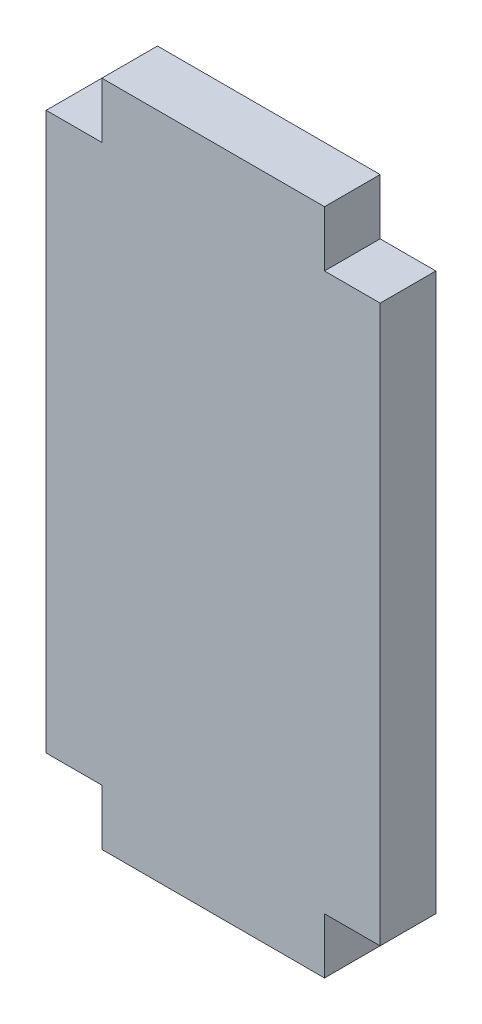
ISO-10303-21;
HEADER;
FILE_DESCRIPTION(('STEP AP214'),'2;1');
FILE_NAME('part.step','',(''),(''),'','','');
FILE_SCHEMA(('AUTOMOTIVE_DESIGN { 1 0 10303 214 1 1 1 1 }'));
ENDSEC;
DATA;
#1=APPLICATION_CONTEXT('core data for automotive mechanical design processes');
#2=APPLICATION_PROTOCOL_DEFINITION('international standard','automotive_design',2000,#1);
#3=PRODUCT_CONTEXT('',#1,'mechanical');
#4=PRODUCT('Part','Part','',(#3));
#5=PRODUCT_RELATED_PRODUCT_CATEGORY('part','',(#4));
#6=PRODUCT_DEFINITION_FORMATION('','',#4);
#7=PRODUCT_DEFINITION_CONTEXT('part definition',#1,'design');
#8=PRODUCT_DEFINITION('design','',#6,#7);
#9=PRODUCT_DEFINITION_SHAPE('','',#8);
#10=(LENGTH_UNIT() NAMED_UNIT(*) SI_UNIT(.MILLI.,.METRE.));
#11=(NAMED_UNIT(*) PLANE_ANGLE_UNIT() SI_UNIT($,.RADIAN.));
#12=(NAMED_UNIT(*) SI_UNIT($,.STERADIAN.) SOLID_ANGLE_UNIT());
#13=UNCERTAINTY_MEASURE_WITH_UNIT(LENGTH_MEASURE(1.E-05),#10,'distance_accuracy_value','');
#14=(GEOMETRIC_REPRESENTATION_CONTEXT(3) GLOBAL_UNCERTAINTY_ASSIGNED_CONTEXT((#13)) GLOBAL_UNIT_ASSIGNED_CONTEXT((#10,
#11,#12)) REPRESENTATION_CONTEXT('',''));
#15=CARTESIAN_POINT('',(0.,0.,0.));
#16=DIRECTION('',(0.,0.,1.));
#17=DIRECTION('',(1.,0.,0.));
#18=AXIS2_PLACEMENT_3D('',#15,#16,#17);
#19=CARTESIAN_POINT('',(28.598756904974,-3.95833333333331,5.));
#20=DIRECTION('',(1.,0.,0.));
#21=DIRECTION('',(0.,0.,-1.));
#22=AXIS2_PLACEMENT_3D('',#19,#20,#21);
#23=PLANE('',#22);
#24=DIRECTION('',(0.,-1.,0.));
#25=VECTOR('',#24,1.);
#26=CARTESIAN_POINT('',(28.598756904974,-3.95833333333331,0.));
#27=LINE('',#26,#25);
#28=CARTESIAN_POINT('',(28.598756904974,46.0416666666667,0.));
#29=VERTEX_POINT('',#28);
#30=CARTESIAN_POINT('',(28.598756904974,-3.95833333333331,0.));
#31=VERTEX_POINT('',#30);
#32=EDGE_CURVE('E153',#29,#31,#27,.T.);
#33=ORIENTED_EDGE('',*,*,#32,.T.);
#34=DIRECTION('',(0.,0.,-1.));
#35=VECTOR('',#34,1.);
#36=CARTESIAN_POINT('',(28.598756904974,-3.95833333333331,5.));
#37=LINE('',#36,#35);
#38=CARTESIAN_POINT('',(28.598756904974,-3.95833333333331,5.));
#39=VERTEX_POINT('',#38);
#40=EDGE_CURVE('E11',#39,#31,#37,.T.);
#41=ORIENTED_EDGE('',*,*,#40,.F.);
#42=DIRECTION('',(0.,-1.,0.));
#43=VECTOR('',#42,1.);
#44=CARTESIAN_POINT('',(28.598756904974,-3.95833333333331,5.));
#45=LINE('',#44,#43);
#46=CARTESIAN_POINT('',(28.598756904974,46.0416666666667,5.));
#47=VERTEX_POINT('',#46);
#48=EDGE_CURVE('E175',#47,#39,#45,.T.);
#49=ORIENTED_EDGE('',*,*,#48,.F.);
#50=DIRECTION('',(0.,0.,-1.));
#51=VECTOR('',#50,1.);
#52=CARTESIAN_POINT('',(28.598756904974,46.0416666666667,5.));
#53=LINE('',#52,#51);
#54=EDGE_CURVE('E149',#47,#29,#53,.T.);
#55=ORIENTED_EDGE('',*,*,#54,.T.);
#56=EDGE_LOOP('',(#33,#41,#49,#55));
#57=FACE_BOUND('',#56,.T.);
#58=ADVANCED_FACE('F33',(#57),#23,.F.);
#59=CARTESIAN_POINT('',(33.598756904974,-3.95833333333331,5.));
#60=DIRECTION('',(0.,1.,0.));
#61=DIRECTION('',(-1.,0.,0.));
#62=AXIS2_PLACEMENT_3D('',#59,#60,#61);
#63=PLANE('',#62);
#64=DIRECTION('',(1.,0.,0.));
#65=VECTOR('',#64,1.);
#66=CARTESIAN_POINT('',(33.598756904974,-3.95833333333331,0.));
#67=LINE('',#66,#65);
#68=CARTESIAN_POINT('',(33.598756904974,-3.95833333333331,0.));
#69=VERTEX_POINT('',#68);
#70=EDGE_CURVE('E156',#31,#69,#67,.T.);
#71=ORIENTED_EDGE('',*,*,#70,.T.);
#72=DIRECTION('',(0.,0.,-1.));
#73=VECTOR('',#72,1.);
#74=CARTESIAN_POINT('',(33.598756904974,-3.95833333333331,5.));
#75=LINE('',#74,#73);
#76=CARTESIAN_POINT('',(33.598756904974,-3.95833333333331,5.));
#77=VERTEX_POINT('',#76);
#78=EDGE_CURVE('E41',#77,#69,#75,.T.);
#79=ORIENTED_EDGE('',*,*,#78,.F.);
#80=DIRECTION('',(1.,0.,0.));
#81=VECTOR('',#80,1.);
#82=CARTESIAN_POINT('',(33.598756904974,-3.95833333333331,5.));
#83=LINE('',#82,#81);
#84=EDGE_CURVE('E104',#39,#77,#83,.T.);
#85=ORIENTED_EDGE('',*,*,#84,.F.);
#86=ORIENTED_EDGE('',*,*,#40,.T.);
#87=EDGE_LOOP('',(#71,#79,#85,#86));
#88=FACE_BOUND('',#87,.T.);
#89=ADVANCED_FACE('F253',(#88),#63,.F.);
#90=CARTESIAN_POINT('',(33.598756904974,-8.95833333333332,5.));
#91=DIRECTION('',(1.,0.,0.));
#92=DIRECTION('',(0.,1.,0.));
#93=AXIS2_PLACEMENT_3D('',#90,#91,#92);
#94=PLANE('',#93);
#95=DIRECTION('',(0.,-1.,0.));
#96=VECTOR('',#95,1.);
#97=CARTESIAN_POINT('',(33.598756904974,-8.95833333333332,0.));
#98=LINE('',#97,#96);
#99=CARTESIAN_POINT('',(33.598756904974,-8.95833333333332,0.));
#100=VERTEX_POINT('',#99);
#101=EDGE_CURVE('E158',#69,#100,#98,.T.);
#102=ORIENTED_EDGE('',*,*,#101,.T.);
#103=DIRECTION('',(0.,0.,-1.));
#104=VECTOR('',#103,1.);
#105=CARTESIAN_POINT('',(33.598756904974,-8.95833333333332,5.));
#106=LINE('',#105,#104);
#107=CARTESIAN_POINT('',(33.598756904974,-8.95833333333332,5.));
#108=VERTEX_POINT('',#107);
#109=EDGE_CURVE('E194',#108,#100,#106,.T.);
#110=ORIENTED_EDGE('',*,*,#109,.F.);
#111=DIRECTION('',(0.,-1.,0.));
#112=VECTOR('',#111,1.);
#113=CARTESIAN_POINT('',(33.598756904974,-8.95833333333332,5.));
#114=LINE('',#113,#112);
#115=EDGE_CURVE('E202',#77,#108,#114,.T.);
#116=ORIENTED_EDGE('',*,*,#115,.F.);
#117=ORIENTED_EDGE('',*,*,#78,.T.);
#118=EDGE_LOOP('',(#102,#110,#116,#117));
#119=FACE_BOUND('',#118,.T.);
#120=ADVANCED_FACE('F200',(#119),#94,.F.);
#121=CARTESIAN_POINT('',(53.598756904974,-8.95833333333331,5.));
#122=DIRECTION('',(0.,1.,0.));
#123=DIRECTION('',(-1.,0.,0.));
#124=AXIS2_PLACEMENT_3D('',#121,#122,#123);
#125=PLANE('',#124);
#126=DIRECTION('',(1.,0.,0.));
#127=VECTOR('',#126,1.);
#128=CARTESIAN_POINT('',(53.598756904974,-8.95833333333331,0.));
#129=LINE('',#128,#127);
#130=CARTESIAN_POINT('',(53.598756904974,-8.95833333333331,0.));
#131=VERTEX_POINT('',#130);
#132=EDGE_CURVE('E160',#100,#131,#129,.T.);
#133=ORIENTED_EDGE('',*,*,#132,.T.);
#134=DIRECTION('',(0.,0.,-1.));
#135=VECTOR('',#134,1.);
#136=CARTESIAN_POINT('',(53.598756904974,-8.95833333333331,5.));
#137=LINE('',#136,#135);
#138=CARTESIAN_POINT('',(53.598756904974,-8.95833333333331,5.));
#139=VERTEX_POINT('',#138);
#140=EDGE_CURVE('E191',#139,#131,#137,.T.);
#141=ORIENTED_EDGE('',*,*,#140,.F.);
#142=DIRECTION('',(1.,0.,0.));
#143=VECTOR('',#142,1.);
#144=CARTESIAN_POINT('',(53.598756904974,-8.95833333333331,5.));
#145=LINE('',#144,#143);
#146=EDGE_CURVE('E220',#108,#139,#145,.T.);
#147=ORIENTED_EDGE('',*,*,#146,.F.);
#148=ORIENTED_EDGE('',*,*,#109,.T.);
#149=EDGE_LOOP('',(#133,#141,#147,#148));
#150=FACE_BOUND('',#149,.T.);
#151=ADVANCED_FACE('F211',(#150),#125,.F.);
#152=CARTESIAN_POINT('',(53.598756904974,-3.95833333333331,5.));
#153=DIRECTION('',(-1.,0.,0.));
#154=DIRECTION('',(0.,0.,1.));
#155=AXIS2_PLACEMENT_3D('',#152,#153,#154);
#156=PLANE('',#155);
#157=DIRECTION('',(0.,1.,0.));
#158=VECTOR('',#157,1.);
#159=CARTESIAN_POINT('',(53.598756904974,-3.95833333333331,0.));
#160=LINE('',#159,#158);
#161=CARTESIAN_POINT('',(53.598756904974,-3.95833333333331,0.));
#162=VERTEX_POINT('',#161);
#163=EDGE_CURVE('E162',#131,#162,#160,.T.);
#164=ORIENTED_EDGE('',*,*,#163,.T.);
#165=DIRECTION('',(0.,0.,-1.));
#166=VECTOR('',#165,1.);
#167=CARTESIAN_POINT('',(53.598756904974,-3.95833333333331,5.));
#168=LINE('',#167,#166);
#169=CARTESIAN_POINT('',(53.598756904974,-3.95833333333331,5.));
#170=VERTEX_POINT('',#169);
#171=EDGE_CURVE('E188',#170,#162,#168,.T.);
#172=ORIENTED_EDGE('',*,*,#171,.F.);
#173=DIRECTION('',(0.,1.,0.));
#174=VECTOR('',#173,1.);
#175=CARTESIAN_POINT('',(53.598756904974,-3.95833333333331,5.));
#176=LINE('',#175,#174);
#177=EDGE_CURVE('E217',#139,#170,#176,.T.);
#178=ORIENTED_EDGE('',*,*,#177,.F.);
#179=ORIENTED_EDGE('',*,*,#140,.T.);
#180=EDGE_LOOP('',(#164,#172,#178,#179));
#181=FACE_BOUND('',#180,.T.);
#182=ADVANCED_FACE('F215',(#181),#156,.F.);
#183=CARTESIAN_POINT('',(58.598756904974,-3.95833333333331,5.));
#184=DIRECTION('',(0.,1.,0.));
#185=DIRECTION('',(-1.,0.,0.));
#186=AXIS2_PLACEMENT_3D('',#183,#184,#185);
#187=PLANE('',#186);
#188=DIRECTION('',(1.,0.,0.));
#189=VECTOR('',#188,1.);
#190=CARTESIAN_POINT('',(58.598756904974,-3.95833333333331,0.));
#191=LINE('',#190,#189);
#192=CARTESIAN_POINT('',(58.598756904974,-3.95833333333331,0.));
#193=VERTEX_POINT('',#192);
#194=EDGE_CURVE('E164',#162,#193,#191,.T.);
#195=ORIENTED_EDGE('',*,*,#194,.T.);
#196=DIRECTION('',(0.,0.,-1.));
#197=VECTOR('',#196,1.);
#198=CARTESIAN_POINT('',(58.598756904974,-3.95833333333331,5.));
#199=LINE('',#198,#197);
#200=CARTESIAN_POINT('',(58.598756904974,-3.95833333333331,5.));
#201=VERTEX_POINT('',#200);
#202=EDGE_CURVE('E185',#201,#193,#199,.T.);
#203=ORIENTED_EDGE('',*,*,#202,.F.);
#204=DIRECTION('',(1.,0.,0.));
#205=VECTOR('',#204,1.);
#206=CARTESIAN_POINT('',(58.598756904974,-3.95833333333331,5.));
#207=LINE('',#206,#205);
#208=EDGE_CURVE('E219',#170,#201,#207,.T.);
#209=ORIENTED_EDGE('',*,*,#208,.F.);
#210=ORIENTED_EDGE('',*,*,#171,.T.);
#211=EDGE_LOOP('',(#195,#203,#209,#210));
#212=FACE_BOUND('',#211,.T.);
#213=ADVANCED_FACE('F266',(#212),#187,.F.);
#214=CARTESIAN_POINT('',(58.598756904974,46.0416666666667,5.));
#215=DIRECTION('',(-1.,0.,0.));
#216=DIRECTION('',(0.,-1.,0.));
#217=AXIS2_PLACEMENT_3D('',#214,#215,#216);
#218=PLANE('',#217);
#219=DIRECTION('',(0.,1.,0.));
#220=VECTOR('',#219,1.);
#221=CARTESIAN_POINT('',(58.598756904974,46.0416666666667,0.));
#222=LINE('',#221,#220);
#223=CARTESIAN_POINT('',(58.598756904974,46.0416666666667,0.));
#224=VERTEX_POINT('',#223);
#225=EDGE_CURVE('E166',#193,#224,#222,.T.);
#226=ORIENTED_EDGE('',*,*,#225,.T.);
#227=DIRECTION('',(0.,0.,-1.));
#228=VECTOR('',#227,1.);
#229=CARTESIAN_POINT('',(58.598756904974,46.0416666666667,5.));
#230=LINE('',#229,#228);
#231=CARTESIAN_POINT('',(58.598756904974,46.0416666666667,5.));
#232=VERTEX_POINT('',#231);
#233=EDGE_CURVE('E182',#232,#224,#230,.T.);
#234=ORIENTED_EDGE('',*,*,#233,.F.);
#235=DIRECTION('',(0.,1.,0.));
#236=VECTOR('',#235,1.);
#237=CARTESIAN_POINT('',(58.598756904974,46.0416666666667,5.));
#238=LINE('',#237,#236);
#239=EDGE_CURVE('E222',#201,#232,#238,.T.);
#240=ORIENTED_EDGE('',*,*,#239,.F.);
#241=ORIENTED_EDGE('',*,*,#202,.T.);
#242=EDGE_LOOP('',(#226,#234,#240,#241));
#243=FACE_BOUND('',#242,.T.);
#244=ADVANCED_FACE('F269',(#243),#218,.F.);
#245=CARTESIAN_POINT('',(53.598756904974,46.0416666666667,5.));
#246=DIRECTION('',(0.,-1.,0.));
#247=DIRECTION('',(0.,0.,-1.));
#248=AXIS2_PLACEMENT_3D('',#245,#246,#247);
#249=PLANE('',#248);
#250=DIRECTION('',(-1.,0.,0.));
#251=VECTOR('',#250,1.);
#252=CARTESIAN_POINT('',(53.598756904974,46.0416666666667,0.));
#253=LINE('',#252,#251);
#254=CARTESIAN_POINT('',(53.598756904974,46.0416666666667,0.));
#255=VERTEX_POINT('',#254);
#256=EDGE_CURVE('E168',#224,#255,#253,.T.);
#257=ORIENTED_EDGE('',*,*,#256,.T.);
#258=DIRECTION('',(0.,0.,-1.));
#259=VECTOR('',#258,1.);
#260=CARTESIAN_POINT('',(53.598756904974,46.0416666666667,5.));
#261=LINE('',#260,#259);
#262=CARTESIAN_POINT('',(53.598756904974,46.0416666666667,5.));
#263=VERTEX_POINT('',#262);
#264=EDGE_CURVE('E179',#263,#255,#261,.T.);
#265=ORIENTED_EDGE('',*,*,#264,.F.);
#266=DIRECTION('',(-1.,0.,0.));
#267=VECTOR('',#266,1.);
#268=CARTESIAN_POINT('',(53.598756904974,46.0416666666667,5.));
#269=LINE('',#268,#267);
#270=EDGE_CURVE('E228',#232,#263,#269,.T.);
#271=ORIENTED_EDGE('',*,*,#270,.F.);
#272=ORIENTED_EDGE('',*,*,#233,.T.);
#273=EDGE_LOOP('',(#257,#265,#271,#272));
#274=FACE_BOUND('',#273,.T.);
#275=ADVANCED_FACE('F234',(#274),#249,.F.);
#276=CARTESIAN_POINT('',(53.598756904974,51.0416666666667,5.));
#277=DIRECTION('',(-1.,0.,0.));
#278=DIRECTION('',(0.,0.,1.));
#279=AXIS2_PLACEMENT_3D('',#276,#277,#278);
#280=PLANE('',#279);
#281=DIRECTION('',(0.,1.,0.));
#282=VECTOR('',#281,1.);
#283=CARTESIAN_POINT('',(53.598756904974,51.0416666666667,0.));
#284=LINE('',#283,#282);
#285=CARTESIAN_POINT('',(53.598756904974,51.0416666666667,0.));
#286=VERTEX_POINT('',#285);
#287=EDGE_CURVE('E170',#255,#286,#284,.T.);
#288=ORIENTED_EDGE('',*,*,#287,.T.);
#289=DIRECTION('',(0.,0.,-1.));
#290=VECTOR('',#289,1.);
#291=CARTESIAN_POINT('',(53.598756904974,51.0416666666667,5.));
#292=LINE('',#291,#290);
#293=CARTESIAN_POINT('',(53.598756904974,51.0416666666667,5.));
#294=VERTEX_POINT('',#293);
#295=EDGE_CURVE('E144',#294,#286,#292,.T.);
#296=ORIENTED_EDGE('',*,*,#295,.F.);
#297=DIRECTION('',(0.,1.,0.));
#298=VECTOR('',#297,1.);
#299=CARTESIAN_POINT('',(53.598756904974,51.0416666666667,5.));
#300=LINE('',#299,#298);
#301=EDGE_CURVE('E135',#263,#294,#300,.T.);
#302=ORIENTED_EDGE('',*,*,#301,.F.);
#303=ORIENTED_EDGE('',*,*,#264,.T.);
#304=EDGE_LOOP('',(#288,#296,#302,#303));
#305=FACE_BOUND('',#304,.T.);
#306=ADVANCED_FACE('F238',(#305),#280,.F.);
#307=CARTESIAN_POINT('',(33.598756904974,51.0416666666667,5.));
#308=DIRECTION('',(0.,-1.,0.));
#309=DIRECTION('',(0.,0.,-1.));
#310=AXIS2_PLACEMENT_3D('',#307,#308,#309);
#311=PLANE('',#310);
#312=DIRECTION('',(-1.,0.,0.));
#313=VECTOR('',#312,1.);
#314=CARTESIAN_POINT('',(33.598756904974,51.0416666666667,0.));
#315=LINE('',#314,#313);
#316=CARTESIAN_POINT('',(33.598756904974,51.0416666666667,0.));
#317=VERTEX_POINT('',#316);
#318=EDGE_CURVE('E143',#286,#317,#315,.T.);
#319=ORIENTED_EDGE('',*,*,#318,.T.);
#320=DIRECTION('',(0.,0.,-1.));
#321=VECTOR('',#320,1.);
#322=CARTESIAN_POINT('',(33.598756904974,51.0416666666667,5.));
#323=LINE('',#322,#321);
#324=CARTESIAN_POINT('',(33.598756904974,51.0416666666667,5.));
#325=VERTEX_POINT('',#324);
#326=EDGE_CURVE('E140',#325,#317,#323,.T.);
#327=ORIENTED_EDGE('',*,*,#326,.F.);
#328=DIRECTION('',(-1.,0.,0.));
#329=VECTOR('',#328,1.);
#330=CARTESIAN_POINT('',(33.598756904974,51.0416666666667,5.));
#331=LINE('',#330,#329);
#332=EDGE_CURVE('E129',#294,#325,#331,.T.);
#333=ORIENTED_EDGE('',*,*,#332,.F.);
#334=ORIENTED_EDGE('',*,*,#295,.T.);
#335=EDGE_LOOP('',(#319,#327,#333,#334));
#336=FACE_BOUND('',#335,.T.);
#337=ADVANCED_FACE('F141',(#336),#311,.F.);
#338=CARTESIAN_POINT('',(33.598756904974,46.0416666666667,5.));
#339=DIRECTION('',(1.,0.,0.));
#340=DIRECTION('',(0.,1.,0.));
#341=AXIS2_PLACEMENT_3D('',#338,#339,#340);
#342=PLANE('',#341);
#343=DIRECTION('',(0.,-1.,0.));
#344=VECTOR('',#343,1.);
#345=CARTESIAN_POINT('',(33.598756904974,46.0416666666667,0.));
#346=LINE('',#345,#344);
#347=CARTESIAN_POINT('',(33.598756904974,46.0416666666667,0.));
#348=VERTEX_POINT('',#347);
#349=EDGE_CURVE('E90',#317,#348,#346,.T.);
#350=ORIENTED_EDGE('',*,*,#349,.T.);
#351=DIRECTION('',(0.,0.,-1.));
#352=VECTOR('',#351,1.);
#353=CARTESIAN_POINT('',(33.598756904974,46.0416666666667,5.));
#354=LINE('',#353,#352);
#355=CARTESIAN_POINT('',(33.598756904974,46.0416666666667,5.));
#356=VERTEX_POINT('',#355);
#357=EDGE_CURVE('E145',#356,#348,#354,.T.);
#358=ORIENTED_EDGE('',*,*,#357,.F.);
#359=DIRECTION('',(0.,-1.,0.));
#360=VECTOR('',#359,1.);
#361=CARTESIAN_POINT('',(33.598756904974,46.0416666666667,5.));
#362=LINE('',#361,#360);
#363=EDGE_CURVE('E133',#325,#356,#362,.T.);
#364=ORIENTED_EDGE('',*,*,#363,.F.);
#365=ORIENTED_EDGE('',*,*,#326,.T.);
#366=EDGE_LOOP('',(#350,#358,#364,#365));
#367=FACE_BOUND('',#366,.T.);
#368=ADVANCED_FACE('F147',(#367),#342,.F.);
#369=CARTESIAN_POINT('',(28.598756904974,46.0416666666667,5.));
#370=DIRECTION('',(0.,-1.,0.));
#371=DIRECTION('',(0.,0.,-1.));
#372=AXIS2_PLACEMENT_3D('',#369,#370,#371);
#373=PLANE('',#372);
#374=DIRECTION('',(-1.,0.,0.));
#375=VECTOR('',#374,1.);
#376=CARTESIAN_POINT('',(28.598756904974,46.0416666666667,0.));
#377=LINE('',#376,#375);
#378=EDGE_CURVE('E96',#348,#29,#377,.T.);
#379=ORIENTED_EDGE('',*,*,#378,.T.);
#380=ORIENTED_EDGE('',*,*,#54,.F.);
#381=DIRECTION('',(-1.,0.,0.));
#382=VECTOR('',#381,1.);
#383=CARTESIAN_POINT('',(28.598756904974,46.0416666666667,5.));
#384=LINE('',#383,#382);
#385=EDGE_CURVE('E49',#356,#47,#384,.T.);
#386=ORIENTED_EDGE('',*,*,#385,.F.);
#387=ORIENTED_EDGE('',*,*,#357,.T.);
#388=EDGE_LOOP('',(#379,#380,#386,#387));
#389=FACE_BOUND('',#388,.T.);
#390=ADVANCED_FACE('F242',(#389),#373,.F.);
#391=CARTESIAN_POINT('',(0.,0.,5.));
#392=DIRECTION('',(0.,0.,-1.));
#393=DIRECTION('',(-1.,0.,0.));
#394=AXIS2_PLACEMENT_3D('',#391,#392,#393);
#395=PLANE('',#394);
#396=ORIENTED_EDGE('',*,*,#48,.T.);
#397=ORIENTED_EDGE('',*,*,#84,.T.);
#398=ORIENTED_EDGE('',*,*,#115,.T.);
#399=ORIENTED_EDGE('',*,*,#146,.T.);
#400=ORIENTED_EDGE('',*,*,#177,.T.);
#401=ORIENTED_EDGE('',*,*,#208,.T.);
#402=ORIENTED_EDGE('',*,*,#239,.T.);
#403=ORIENTED_EDGE('',*,*,#270,.T.);
#404=ORIENTED_EDGE('',*,*,#301,.T.);
#405=ORIENTED_EDGE('',*,*,#332,.T.);
#406=ORIENTED_EDGE('',*,*,#363,.T.);
#407=ORIENTED_EDGE('',*,*,#385,.T.);
#408=EDGE_LOOP('',(#396,#397,#398,#399,#400,#401,#402,#403,#404,#405,#406,#407));
#409=FACE_BOUND('',#408,.T.);
#410=ADVANCED_FACE('F131',(#409),#395,.F.);
#411=CARTESIAN_POINT('',(0.,0.,0.));
#412=DIRECTION('',(0.,0.,-1.));
#413=DIRECTION('',(-1.,0.,0.));
#414=AXIS2_PLACEMENT_3D('',#411,#412,#413);
#415=PLANE('',#414);
#416=ORIENTED_EDGE('',*,*,#32,.F.);
#417=ORIENTED_EDGE('',*,*,#378,.F.);
#418=ORIENTED_EDGE('',*,*,#349,.F.);
#419=ORIENTED_EDGE('',*,*,#318,.F.);
#420=ORIENTED_EDGE('',*,*,#287,.F.);
#421=ORIENTED_EDGE('',*,*,#256,.F.);
#422=ORIENTED_EDGE('',*,*,#225,.F.);
#423=ORIENTED_EDGE('',*,*,#194,.F.);
#424=ORIENTED_EDGE('',*,*,#163,.F.);
#425=ORIENTED_EDGE('',*,*,#132,.F.);
#426=ORIENTED_EDGE('',*,*,#101,.F.);
#427=ORIENTED_EDGE('',*,*,#70,.F.);
#428=EDGE_LOOP('',(#416,#417,#418,#419,#420,#421,#422,#423,#424,#425,#426,#427));
#429=FACE_BOUND('',#428,.T.);
#430=ADVANCED_FACE('F206',(#429),#415,.T.);
#431=CLOSED_SHELL('',(#58,#89,#120,#151,#182,#213,#244,#275,#306,#337,#368,#390,#410,#430));
#432=MANIFOLD_SOLID_BREP('B2',#431);
#433=ADVANCED_BREP_SHAPE_REPRESENTATION('',(#18,#432),#14);
#434=SHAPE_DEFINITION_REPRESENTATION(#9,#433);
ENDSEC;
END-ISO-10303-21;
